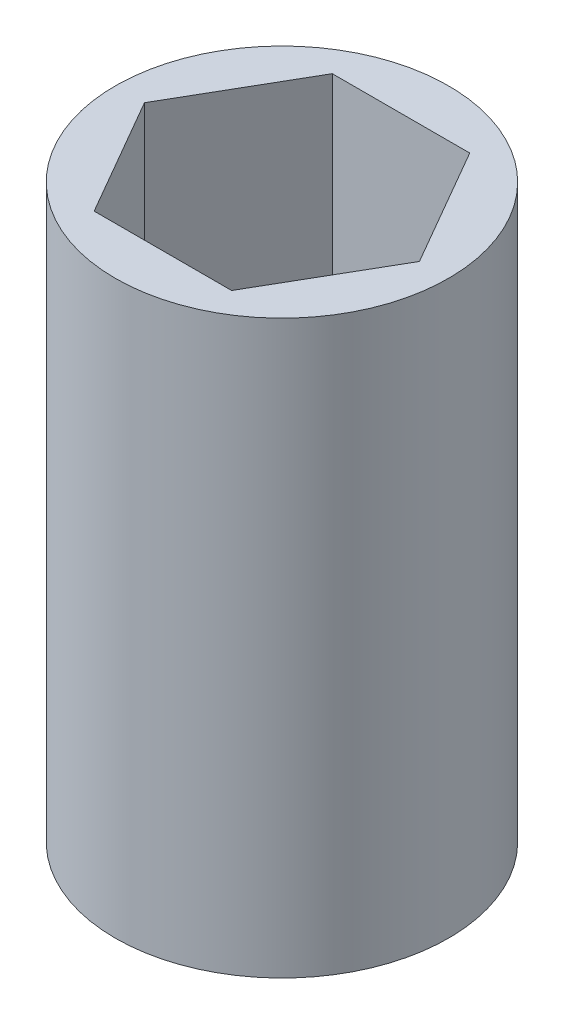
ISO-10303-21;
HEADER;
FILE_DESCRIPTION(('STEP AP214'),'2;1');
FILE_NAME('part.step','',(''),(''),'','','');
FILE_SCHEMA(('AUTOMOTIVE_DESIGN { 1 0 10303 214 1 1 1 1 }'));
ENDSEC;
DATA;
#1=APPLICATION_CONTEXT('core data for automotive mechanical design processes');
#2=APPLICATION_PROTOCOL_DEFINITION('international standard','automotive_design',2000,#1);
#3=PRODUCT_CONTEXT('',#1,'mechanical');
#4=PRODUCT('Part','Part','',(#3));
#5=PRODUCT_RELATED_PRODUCT_CATEGORY('part','',(#4));
#6=PRODUCT_DEFINITION_FORMATION('','',#4);
#7=PRODUCT_DEFINITION_CONTEXT('part definition',#1,'design');
#8=PRODUCT_DEFINITION('design','',#6,#7);
#9=PRODUCT_DEFINITION_SHAPE('','',#8);
#10=(LENGTH_UNIT() NAMED_UNIT(*) SI_UNIT(.MILLI.,.METRE.));
#11=(NAMED_UNIT(*) PLANE_ANGLE_UNIT() SI_UNIT($,.RADIAN.));
#12=(NAMED_UNIT(*) SI_UNIT($,.STERADIAN.) SOLID_ANGLE_UNIT());
#13=UNCERTAINTY_MEASURE_WITH_UNIT(LENGTH_MEASURE(1.E-05),#10,'distance_accuracy_value','');
#14=(GEOMETRIC_REPRESENTATION_CONTEXT(3) GLOBAL_UNCERTAINTY_ASSIGNED_CONTEXT((#13)) GLOBAL_UNIT_ASSIGNED_CONTEXT((#10,
#11,#12)) REPRESENTATION_CONTEXT('',''));
#15=CARTESIAN_POINT('',(0.,0.,0.));
#16=DIRECTION('',(0.,0.,1.));
#17=DIRECTION('',(1.,0.,0.));
#18=AXIS2_PLACEMENT_3D('',#15,#16,#17);
#19=CARTESIAN_POINT('',(0.,12.,0.));
#20=DIRECTION('',(0.,-1.,0.));
#21=DIRECTION('',(0.,0.,-1.));
#22=AXIS2_PLACEMENT_3D('',#19,#20,#21);
#23=CYLINDRICAL_SURFACE('',#22,3.5);
#24=CARTESIAN_POINT('',(0.,12.,0.));
#25=DIRECTION('',(0.,1.,0.));
#26=DIRECTION('',(0.,0.,1.));
#27=AXIS2_PLACEMENT_3D('',#24,#25,#26);
#28=CIRCLE('',#27,3.5);
#29=CARTESIAN_POINT('',(0.,12.,3.5));
#30=VERTEX_POINT('',#29);
#31=EDGE_CURVE('E11',#30,#30,#28,.T.);
#32=ORIENTED_EDGE('',*,*,#31,.F.);
#33=EDGE_LOOP('',(#32));
#34=FACE_BOUND('',#33,.T.);
#35=CARTESIAN_POINT('',(0.,0.,0.));
#36=DIRECTION('',(0.,1.,0.));
#37=DIRECTION('',(0.,0.,1.));
#38=AXIS2_PLACEMENT_3D('',#35,#36,#37);
#39=CIRCLE('',#38,3.5);
#40=CARTESIAN_POINT('',(0.,0.,3.5));
#41=VERTEX_POINT('',#40);
#42=EDGE_CURVE('E41',#41,#41,#39,.T.);
#43=ORIENTED_EDGE('',*,*,#42,.T.);
#44=EDGE_LOOP('',(#43));
#45=FACE_BOUND('',#44,.T.);
#46=ADVANCED_FACE('F38',(#34,#45),#23,.T.);
#47=CARTESIAN_POINT('',(0.,12.,0.));
#48=DIRECTION('',(0.,1.,0.));
#49=DIRECTION('',(0.,0.,1.));
#50=AXIS2_PLACEMENT_3D('',#47,#48,#49);
#51=PLANE('',#50);
#52=DIRECTION('',(0.5,0.,-0.866025403784439));
#53=VECTOR('',#52,1.);
#54=CARTESIAN_POINT('',(1.44337567297406,12.,2.5));
#55=LINE('',#54,#53);
#56=CARTESIAN_POINT('',(1.44337567297406,12.,2.5));
#57=VERTEX_POINT('',#56);
#58=CARTESIAN_POINT('',(2.88675134594813,12.,0.));
#59=VERTEX_POINT('',#58);
#60=EDGE_CURVE('E52',#57,#59,#55,.T.);
#61=ORIENTED_EDGE('',*,*,#60,.F.);
#62=DIRECTION('',(1.,0.,0.));
#63=VECTOR('',#62,1.);
#64=CARTESIAN_POINT('',(-1.44337567297407,12.,2.5));
#65=LINE('',#64,#63);
#66=CARTESIAN_POINT('',(-1.44337567297407,12.,2.5));
#67=VERTEX_POINT('',#66);
#68=EDGE_CURVE('E135',#67,#57,#65,.T.);
#69=ORIENTED_EDGE('',*,*,#68,.F.);
#70=DIRECTION('',(0.5,0.,0.866025403784439));
#71=VECTOR('',#70,1.);
#72=CARTESIAN_POINT('',(-2.88675134594813,12.,0.));
#73=LINE('',#72,#71);
#74=CARTESIAN_POINT('',(-2.88675134594813,12.,0.));
#75=VERTEX_POINT('',#74);
#76=EDGE_CURVE('E133',#75,#67,#73,.T.);
#77=ORIENTED_EDGE('',*,*,#76,.F.);
#78=DIRECTION('',(-0.5,0.,0.866025403784439));
#79=VECTOR('',#78,1.);
#80=CARTESIAN_POINT('',(-1.44337567297406,12.,-2.5));
#81=LINE('',#80,#79);
#82=CARTESIAN_POINT('',(-1.44337567297406,12.,-2.5));
#83=VERTEX_POINT('',#82);
#84=EDGE_CURVE('E100',#83,#75,#81,.T.);
#85=ORIENTED_EDGE('',*,*,#84,.F.);
#86=DIRECTION('',(-1.,0.,0.));
#87=VECTOR('',#86,1.);
#88=CARTESIAN_POINT('',(1.44337567297406,12.,-2.5));
#89=LINE('',#88,#87);
#90=CARTESIAN_POINT('',(1.44337567297406,12.,-2.5));
#91=VERTEX_POINT('',#90);
#92=EDGE_CURVE('E129',#91,#83,#89,.T.);
#93=ORIENTED_EDGE('',*,*,#92,.F.);
#94=DIRECTION('',(-0.5,0.,-0.866025403784439));
#95=VECTOR('',#94,1.);
#96=CARTESIAN_POINT('',(2.88675134594813,12.,0.));
#97=LINE('',#96,#95);
#98=EDGE_CURVE('E126',#59,#91,#97,.T.);
#99=ORIENTED_EDGE('',*,*,#98,.F.);
#100=EDGE_LOOP('',(#61,#69,#77,#85,#93,#99));
#101=FACE_BOUND('',#100,.T.);
#102=ORIENTED_EDGE('',*,*,#31,.T.);
#103=EDGE_LOOP('',(#102));
#104=FACE_BOUND('',#103,.T.);
#105=ADVANCED_FACE('F148',(#101,#104),#51,.T.);
#106=CARTESIAN_POINT('',(0.,0.,0.));
#107=DIRECTION('',(0.,1.,0.));
#108=DIRECTION('',(0.,0.,1.));
#109=AXIS2_PLACEMENT_3D('',#106,#107,#108);
#110=PLANE('',#109);
#111=ORIENTED_EDGE('',*,*,#42,.F.);
#112=EDGE_LOOP('',(#111));
#113=FACE_BOUND('',#112,.T.);
#114=ADVANCED_FACE('F157',(#113),#110,.F.);
#115=CARTESIAN_POINT('',(1.44337567297406,2.,2.5));
#116=DIRECTION('',(0.866025403784439,0.,0.5));
#117=DIRECTION('',(0.5,0.,-0.866025403784439));
#118=AXIS2_PLACEMENT_3D('',#115,#116,#117);
#119=PLANE('',#118);
#120=ORIENTED_EDGE('',*,*,#60,.T.);
#121=DIRECTION('',(0.,1.,0.));
#122=VECTOR('',#121,1.);
#123=CARTESIAN_POINT('',(2.88675134594813,2.,0.));
#124=LINE('',#123,#122);
#125=CARTESIAN_POINT('',(2.88675134594813,2.,0.));
#126=VERTEX_POINT('',#125);
#127=EDGE_CURVE('E82',#126,#59,#124,.T.);
#128=ORIENTED_EDGE('',*,*,#127,.F.);
#129=DIRECTION('',(0.5,0.,-0.866025403784439));
#130=VECTOR('',#129,1.);
#131=CARTESIAN_POINT('',(1.44337567297406,2.,2.5));
#132=LINE('',#131,#130);
#133=CARTESIAN_POINT('',(1.44337567297406,2.,2.5));
#134=VERTEX_POINT('',#133);
#135=EDGE_CURVE('E137',#134,#126,#132,.T.);
#136=ORIENTED_EDGE('',*,*,#135,.F.);
#137=DIRECTION('',(0.,1.,0.));
#138=VECTOR('',#137,1.);
#139=CARTESIAN_POINT('',(1.44337567297406,2.,2.5));
#140=LINE('',#139,#138);
#141=EDGE_CURVE('E60',#134,#57,#140,.T.);
#142=ORIENTED_EDGE('',*,*,#141,.T.);
#143=EDGE_LOOP('',(#120,#128,#136,#142));
#144=FACE_BOUND('',#143,.T.);
#145=ADVANCED_FACE('F154',(#144),#119,.F.);
#146=CARTESIAN_POINT('',(-1.44337567297407,2.,2.5));
#147=DIRECTION('',(0.,0.,1.));
#148=DIRECTION('',(1.,0.,0.));
#149=AXIS2_PLACEMENT_3D('',#146,#147,#148);
#150=PLANE('',#149);
#151=ORIENTED_EDGE('',*,*,#68,.T.);
#152=ORIENTED_EDGE('',*,*,#141,.F.);
#153=DIRECTION('',(1.,0.,0.));
#154=VECTOR('',#153,1.);
#155=CARTESIAN_POINT('',(-1.44337567297407,2.,2.5));
#156=LINE('',#155,#154);
#157=CARTESIAN_POINT('',(-1.44337567297407,2.,2.5));
#158=VERTEX_POINT('',#157);
#159=EDGE_CURVE('E112',#158,#134,#156,.T.);
#160=ORIENTED_EDGE('',*,*,#159,.F.);
#161=DIRECTION('',(0.,1.,0.));
#162=VECTOR('',#161,1.);
#163=CARTESIAN_POINT('',(-1.44337567297407,2.,2.5));
#164=LINE('',#163,#162);
#165=EDGE_CURVE('E104',#158,#67,#164,.T.);
#166=ORIENTED_EDGE('',*,*,#165,.T.);
#167=EDGE_LOOP('',(#151,#152,#160,#166));
#168=FACE_BOUND('',#167,.T.);
#169=ADVANCED_FACE('F156',(#168),#150,.F.);
#170=CARTESIAN_POINT('',(-2.88675134594813,2.,0.));
#171=DIRECTION('',(-0.866025403784439,0.,0.5));
#172=DIRECTION('',(0.5,0.,0.866025403784439));
#173=AXIS2_PLACEMENT_3D('',#170,#171,#172);
#174=PLANE('',#173);
#175=ORIENTED_EDGE('',*,*,#76,.T.);
#176=ORIENTED_EDGE('',*,*,#165,.F.);
#177=DIRECTION('',(0.5,0.,0.866025403784439));
#178=VECTOR('',#177,1.);
#179=CARTESIAN_POINT('',(-2.88675134594813,2.,0.));
#180=LINE('',#179,#178);
#181=CARTESIAN_POINT('',(-2.88675134594813,2.,0.));
#182=VERTEX_POINT('',#181);
#183=EDGE_CURVE('E108',#182,#158,#180,.T.);
#184=ORIENTED_EDGE('',*,*,#183,.F.);
#185=DIRECTION('',(0.,1.,0.));
#186=VECTOR('',#185,1.);
#187=CARTESIAN_POINT('',(-2.88675134594813,2.,0.));
#188=LINE('',#187,#186);
#189=EDGE_CURVE('E93',#182,#75,#188,.T.);
#190=ORIENTED_EDGE('',*,*,#189,.T.);
#191=EDGE_LOOP('',(#175,#176,#184,#190));
#192=FACE_BOUND('',#191,.T.);
#193=ADVANCED_FACE('F109',(#192),#174,.F.);
#194=CARTESIAN_POINT('',(-1.44337567297406,2.,-2.5));
#195=DIRECTION('',(-0.866025403784438,0.,-0.5));
#196=DIRECTION('',(-0.5,0.,0.866025403784439));
#197=AXIS2_PLACEMENT_3D('',#194,#195,#196);
#198=PLANE('',#197);
#199=ORIENTED_EDGE('',*,*,#84,.T.);
#200=ORIENTED_EDGE('',*,*,#189,.F.);
#201=DIRECTION('',(-0.5,0.,0.866025403784439));
#202=VECTOR('',#201,1.);
#203=CARTESIAN_POINT('',(-1.44337567297406,2.,-2.5));
#204=LINE('',#203,#202);
#205=CARTESIAN_POINT('',(-1.44337567297406,2.,-2.5));
#206=VERTEX_POINT('',#205);
#207=EDGE_CURVE('E97',#206,#182,#204,.T.);
#208=ORIENTED_EDGE('',*,*,#207,.F.);
#209=DIRECTION('',(0.,1.,0.));
#210=VECTOR('',#209,1.);
#211=CARTESIAN_POINT('',(-1.44337567297406,2.,-2.5));
#212=LINE('',#211,#210);
#213=EDGE_CURVE('E105',#206,#83,#212,.T.);
#214=ORIENTED_EDGE('',*,*,#213,.T.);
#215=EDGE_LOOP('',(#199,#200,#208,#214));
#216=FACE_BOUND('',#215,.T.);
#217=ADVANCED_FACE('F95',(#216),#198,.F.);
#218=CARTESIAN_POINT('',(1.44337567297406,2.,-2.5));
#219=DIRECTION('',(0.,0.,-1.));
#220=DIRECTION('',(-1.,0.,0.));
#221=AXIS2_PLACEMENT_3D('',#218,#219,#220);
#222=PLANE('',#221);
#223=ORIENTED_EDGE('',*,*,#92,.T.);
#224=ORIENTED_EDGE('',*,*,#213,.F.);
#225=DIRECTION('',(-1.,0.,0.));
#226=VECTOR('',#225,1.);
#227=CARTESIAN_POINT('',(1.44337567297406,2.,-2.5));
#228=LINE('',#227,#226);
#229=CARTESIAN_POINT('',(1.44337567297406,2.,-2.5));
#230=VERTEX_POINT('',#229);
#231=EDGE_CURVE('E118',#230,#206,#228,.T.);
#232=ORIENTED_EDGE('',*,*,#231,.F.);
#233=DIRECTION('',(0.,1.,0.));
#234=VECTOR('',#233,1.);
#235=CARTESIAN_POINT('',(1.44337567297406,2.,-2.5));
#236=LINE('',#235,#234);
#237=EDGE_CURVE('E141',#230,#91,#236,.T.);
#238=ORIENTED_EDGE('',*,*,#237,.T.);
#239=EDGE_LOOP('',(#223,#224,#232,#238));
#240=FACE_BOUND('',#239,.T.);
#241=ADVANCED_FACE('F152',(#240),#222,.F.);
#242=CARTESIAN_POINT('',(2.88675134594813,2.,0.));
#243=DIRECTION('',(0.866025403784439,0.,-0.5));
#244=DIRECTION('',(-0.5,0.,-0.866025403784439));
#245=AXIS2_PLACEMENT_3D('',#242,#243,#244);
#246=PLANE('',#245);
#247=ORIENTED_EDGE('',*,*,#98,.T.);
#248=ORIENTED_EDGE('',*,*,#237,.F.);
#249=DIRECTION('',(-0.5,0.,-0.866025403784439));
#250=VECTOR('',#249,1.);
#251=CARTESIAN_POINT('',(2.88675134594813,2.,0.));
#252=LINE('',#251,#250);
#253=EDGE_CURVE('E120',#126,#230,#252,.T.);
#254=ORIENTED_EDGE('',*,*,#253,.F.);
#255=ORIENTED_EDGE('',*,*,#127,.T.);
#256=EDGE_LOOP('',(#247,#248,#254,#255));
#257=FACE_BOUND('',#256,.T.);
#258=ADVANCED_FACE('F145',(#257),#246,.F.);
#259=CARTESIAN_POINT('',(0.,2.,0.));
#260=DIRECTION('',(0.,1.,0.));
#261=DIRECTION('',(0.,0.,1.));
#262=AXIS2_PLACEMENT_3D('',#259,#260,#261);
#263=PLANE('',#262);
#264=ORIENTED_EDGE('',*,*,#135,.T.);
#265=ORIENTED_EDGE('',*,*,#253,.T.);
#266=ORIENTED_EDGE('',*,*,#231,.T.);
#267=ORIENTED_EDGE('',*,*,#207,.T.);
#268=ORIENTED_EDGE('',*,*,#183,.T.);
#269=ORIENTED_EDGE('',*,*,#159,.T.);
#270=EDGE_LOOP('',(#264,#265,#266,#267,#268,#269));
#271=FACE_BOUND('',#270,.T.);
#272=ADVANCED_FACE('F115',(#271),#263,.T.);
#273=CLOSED_SHELL('',(#46,#105,#114,#145,#169,#193,#217,#241,#258,#272));
#274=MANIFOLD_SOLID_BREP('B2',#273);
#275=ADVANCED_BREP_SHAPE_REPRESENTATION('',(#18,#274),#14);
#276=SHAPE_DEFINITION_REPRESENTATION(#9,#275);
ENDSEC;
END-ISO-10303-21;
